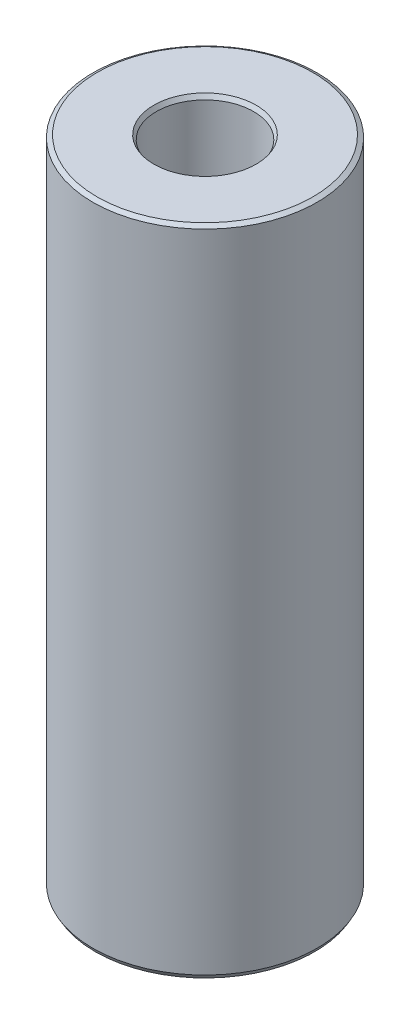
ISO-10303-21;
HEADER;
FILE_DESCRIPTION(('STEP AP214'),'2;1');
FILE_NAME('part.step','',(''),(''),'','','');
FILE_SCHEMA(('AUTOMOTIVE_DESIGN { 1 0 10303 214 1 1 1 1 }'));
ENDSEC;
DATA;
#1=APPLICATION_CONTEXT('core data for automotive mechanical design processes');
#2=APPLICATION_PROTOCOL_DEFINITION('international standard','automotive_design',2000,#1);
#3=PRODUCT_CONTEXT('',#1,'mechanical');
#4=PRODUCT('Part','Part','',(#3));
#5=PRODUCT_RELATED_PRODUCT_CATEGORY('part','',(#4));
#6=PRODUCT_DEFINITION_FORMATION('','',#4);
#7=PRODUCT_DEFINITION_CONTEXT('part definition',#1,'design');
#8=PRODUCT_DEFINITION('design','',#6,#7);
#9=PRODUCT_DEFINITION_SHAPE('','',#8);
#10=(LENGTH_UNIT() NAMED_UNIT(*) SI_UNIT(.MILLI.,.METRE.));
#11=(NAMED_UNIT(*) PLANE_ANGLE_UNIT() SI_UNIT($,.RADIAN.));
#12=(NAMED_UNIT(*) SI_UNIT($,.STERADIAN.) SOLID_ANGLE_UNIT());
#13=UNCERTAINTY_MEASURE_WITH_UNIT(LENGTH_MEASURE(1.E-05),#10,'distance_accuracy_value','');
#14=(GEOMETRIC_REPRESENTATION_CONTEXT(3) GLOBAL_UNCERTAINTY_ASSIGNED_CONTEXT((#13)) GLOBAL_UNIT_ASSIGNED_CONTEXT((#10,
#11,#12)) REPRESENTATION_CONTEXT('',''));
#15=CARTESIAN_POINT('',(0.,0.,0.));
#16=DIRECTION('',(0.,0.,1.));
#17=DIRECTION('',(1.,0.,0.));
#18=AXIS2_PLACEMENT_3D('',#15,#16,#17);
#19=CARTESIAN_POINT('',(0.,291.016992526414,0.));
#20=DIRECTION('',(0.,-1.,0.));
#21=DIRECTION('',(0.,0.,-1.));
#22=AXIS2_PLACEMENT_3D('',#19,#20,#21);
#23=CYLINDRICAL_SURFACE('',#22,50.);
#24=CARTESIAN_POINT('',(0.,1.9169202126163,0.));
#25=DIRECTION('',(0.,1.,0.));
#26=DIRECTION('',(0.,0.,1.));
#27=AXIS2_PLACEMENT_3D('',#24,#25,#26);
#28=CIRCLE('',#27,50.);
#29=CARTESIAN_POINT('',(0.,1.9169202126163,50.));
#30=VERTEX_POINT('',#29);
#31=EDGE_CURVE('E10',#30,#30,#28,.T.);
#32=ORIENTED_EDGE('',*,*,#31,.T.);
#33=EDGE_LOOP('',(#32));
#34=FACE_BOUND('',#33,.T.);
#35=CARTESIAN_POINT('',(0.,289.910258125645,0.));
#36=DIRECTION('',(0.,1.,0.));
#37=DIRECTION('',(0.,0.,1.));
#38=AXIS2_PLACEMENT_3D('',#35,#36,#37);
#39=CIRCLE('',#38,50.);
#40=CARTESIAN_POINT('',(0.,289.910258125645,50.));
#41=VERTEX_POINT('',#40);
#42=EDGE_CURVE('E50',#41,#41,#39,.F.);
#43=ORIENTED_EDGE('',*,*,#42,.T.);
#44=EDGE_LOOP('',(#43));
#45=FACE_BOUND('',#44,.T.);
#46=ADVANCED_FACE('F39',(#34,#45),#23,.T.);
#47=CARTESIAN_POINT('',(0.,291.016992526414,0.));
#48=DIRECTION('',(0.,1.,0.));
#49=DIRECTION('',(0.,0.,1.));
#50=AXIS2_PLACEMENT_3D('',#47,#48,#49);
#51=PLANE('',#50);
#52=CARTESIAN_POINT('',(0.,291.016992526414,0.));
#53=DIRECTION('',(0.,1.,0.));
#54=DIRECTION('',(0.,0.,1.));
#55=AXIS2_PLACEMENT_3D('',#52,#53,#54);
#56=CIRCLE('',#55,22.8124525299069);
#57=CARTESIAN_POINT('',(0.,291.016992526414,22.8124525299069));
#58=VERTEX_POINT('',#57);
#59=EDGE_CURVE('E58',#58,#58,#56,.F.);
#60=ORIENTED_EDGE('',*,*,#59,.T.);
#61=EDGE_LOOP('',(#60));
#62=FACE_BOUND('',#61,.T.);
#63=CARTESIAN_POINT('',(0.,291.016992526414,0.));
#64=DIRECTION('',(0.,1.,0.));
#65=DIRECTION('',(0.,0.,1.));
#66=AXIS2_PLACEMENT_3D('',#63,#64,#65);
#67=CIRCLE('',#66,48.0830797873838);
#68=CARTESIAN_POINT('',(0.,291.016992526414,48.0830797873838));
#69=VERTEX_POINT('',#68);
#70=EDGE_CURVE('E61',#69,#69,#67,.T.);
#71=ORIENTED_EDGE('',*,*,#70,.T.);
#72=EDGE_LOOP('',(#71));
#73=FACE_BOUND('',#72,.T.);
#74=ADVANCED_FACE('F88',(#62,#73),#51,.T.);
#75=CARTESIAN_POINT('',(0.,0.,0.));
#76=DIRECTION('',(0.,1.,0.));
#77=DIRECTION('',(0.,0.,1.));
#78=AXIS2_PLACEMENT_3D('',#75,#76,#77);
#79=PLANE('',#78);
#80=CARTESIAN_POINT('',(0.,0.,0.));
#81=DIRECTION('',(0.,1.,0.));
#82=DIRECTION('',(0.,0.,1.));
#83=AXIS2_PLACEMENT_3D('',#80,#81,#82);
#84=CIRCLE('',#83,23.6226383417541);
#85=CARTESIAN_POINT('',(0.,0.,23.6226383417541));
#86=VERTEX_POINT('',#85);
#87=EDGE_CURVE('E51',#86,#86,#84,.T.);
#88=ORIENTED_EDGE('',*,*,#87,.T.);
#89=EDGE_LOOP('',(#88));
#90=FACE_BOUND('',#89,.T.);
#91=CARTESIAN_POINT('',(0.,0.,0.));
#92=DIRECTION('',(0.,1.,0.));
#93=DIRECTION('',(0.,0.,1.));
#94=AXIS2_PLACEMENT_3D('',#91,#92,#93);
#95=CIRCLE('',#94,48.8932655992309);
#96=CARTESIAN_POINT('',(0.,0.,48.8932655992309));
#97=VERTEX_POINT('',#96);
#98=EDGE_CURVE('E54',#97,#97,#95,.F.);
#99=ORIENTED_EDGE('',*,*,#98,.T.);
#100=EDGE_LOOP('',(#99));
#101=FACE_BOUND('',#100,.T.);
#102=ADVANCED_FACE('F83',(#90,#101),#79,.F.);
#103=CARTESIAN_POINT('',(0.,291.016992526414,0.));
#104=DIRECTION('',(0.,-1.,0.));
#105=DIRECTION('',(0.,0.,-1.));
#106=AXIS2_PLACEMENT_3D('',#103,#104,#105);
#107=CYLINDRICAL_SURFACE('',#106,21.7057181291379);
#108=CARTESIAN_POINT('',(0.,289.100072313798,0.));
#109=DIRECTION('',(0.,1.,0.));
#110=DIRECTION('',(0.,0.,1.));
#111=AXIS2_PLACEMENT_3D('',#108,#109,#110);
#112=CIRCLE('',#111,21.7057181291379);
#113=CARTESIAN_POINT('',(0.,289.100072313798,21.7057181291379));
#114=VERTEX_POINT('',#113);
#115=EDGE_CURVE('E67',#114,#114,#112,.T.);
#116=ORIENTED_EDGE('',*,*,#115,.T.);
#117=EDGE_LOOP('',(#116));
#118=FACE_BOUND('',#117,.T.);
#119=CARTESIAN_POINT('',(0.,1.10673440076903,0.));
#120=DIRECTION('',(0.,1.,0.));
#121=DIRECTION('',(0.,0.,1.));
#122=AXIS2_PLACEMENT_3D('',#119,#120,#121);
#123=CIRCLE('',#122,21.7057181291379);
#124=CARTESIAN_POINT('',(0.,1.10673440076903,21.7057181291379));
#125=VERTEX_POINT('',#124);
#126=EDGE_CURVE('E69',#125,#125,#123,.F.);
#127=ORIENTED_EDGE('',*,*,#126,.T.);
#128=EDGE_LOOP('',(#127));
#129=FACE_BOUND('',#128,.T.);
#130=ADVANCED_FACE('F71',(#118,#129),#107,.F.);
#131=CARTESIAN_POINT('',(0.,289.100072313798,0.));
#132=DIRECTION('',(0.,1.,0.));
#133=DIRECTION('',(0.,0.,1.));
#134=AXIS2_PLACEMENT_3D('',#131,#132,#133);
#135=CONICAL_SURFACE('',#134,21.7057181291379,0.523598775598303);
#136=ORIENTED_EDGE('',*,*,#59,.F.);
#137=EDGE_LOOP('',(#136));
#138=FACE_BOUND('',#137,.T.);
#139=ORIENTED_EDGE('',*,*,#115,.F.);
#140=EDGE_LOOP('',(#139));
#141=FACE_BOUND('',#140,.T.);
#142=ADVANCED_FACE('F77',(#138,#141),#135,.F.);
#143=CARTESIAN_POINT('',(0.,0.,0.));
#144=DIRECTION('',(0.,-1.,0.));
#145=DIRECTION('',(0.,0.,-1.));
#146=AXIS2_PLACEMENT_3D('',#143,#144,#145);
#147=CONICAL_SURFACE('',#146,23.6226383417541,1.04719755119659);
#148=ORIENTED_EDGE('',*,*,#126,.F.);
#149=EDGE_LOOP('',(#148));
#150=FACE_BOUND('',#149,.T.);
#151=ORIENTED_EDGE('',*,*,#87,.F.);
#152=EDGE_LOOP('',(#151));
#153=FACE_BOUND('',#152,.T.);
#154=ADVANCED_FACE('F73',(#150,#153),#147,.F.);
#155=CARTESIAN_POINT('',(0.,1.9169202126163,0.));
#156=DIRECTION('',(0.,1.,0.));
#157=DIRECTION('',(0.,0.,1.));
#158=AXIS2_PLACEMENT_3D('',#155,#156,#157);
#159=CONICAL_SURFACE('',#158,50.,0.523598775598304);
#160=ORIENTED_EDGE('',*,*,#98,.F.);
#161=EDGE_LOOP('',(#160));
#162=FACE_BOUND('',#161,.T.);
#163=ORIENTED_EDGE('',*,*,#31,.F.);
#164=EDGE_LOOP('',(#163));
#165=FACE_BOUND('',#164,.T.);
#166=ADVANCED_FACE('F76',(#162,#165),#159,.T.);
#167=CARTESIAN_POINT('',(0.,291.016992526414,0.));
#168=DIRECTION('',(0.,-1.,0.));
#169=DIRECTION('',(0.,0.,-1.));
#170=AXIS2_PLACEMENT_3D('',#167,#168,#169);
#171=CONICAL_SURFACE('',#170,48.0830797873838,1.04719755119661);
#172=ORIENTED_EDGE('',*,*,#42,.F.);
#173=EDGE_LOOP('',(#172));
#174=FACE_BOUND('',#173,.T.);
#175=ORIENTED_EDGE('',*,*,#70,.F.);
#176=EDGE_LOOP('',(#175));
#177=FACE_BOUND('',#176,.T.);
#178=ADVANCED_FACE('F45',(#174,#177),#171,.T.);
#179=CLOSED_SHELL('',(#46,#74,#102,#130,#142,#154,#166,#178));
#180=MANIFOLD_SOLID_BREP('B2',#179);
#181=ADVANCED_BREP_SHAPE_REPRESENTATION('',(#18,#180),#14);
#182=SHAPE_DEFINITION_REPRESENTATION(#9,#181);
ENDSEC;
END-ISO-10303-21;
